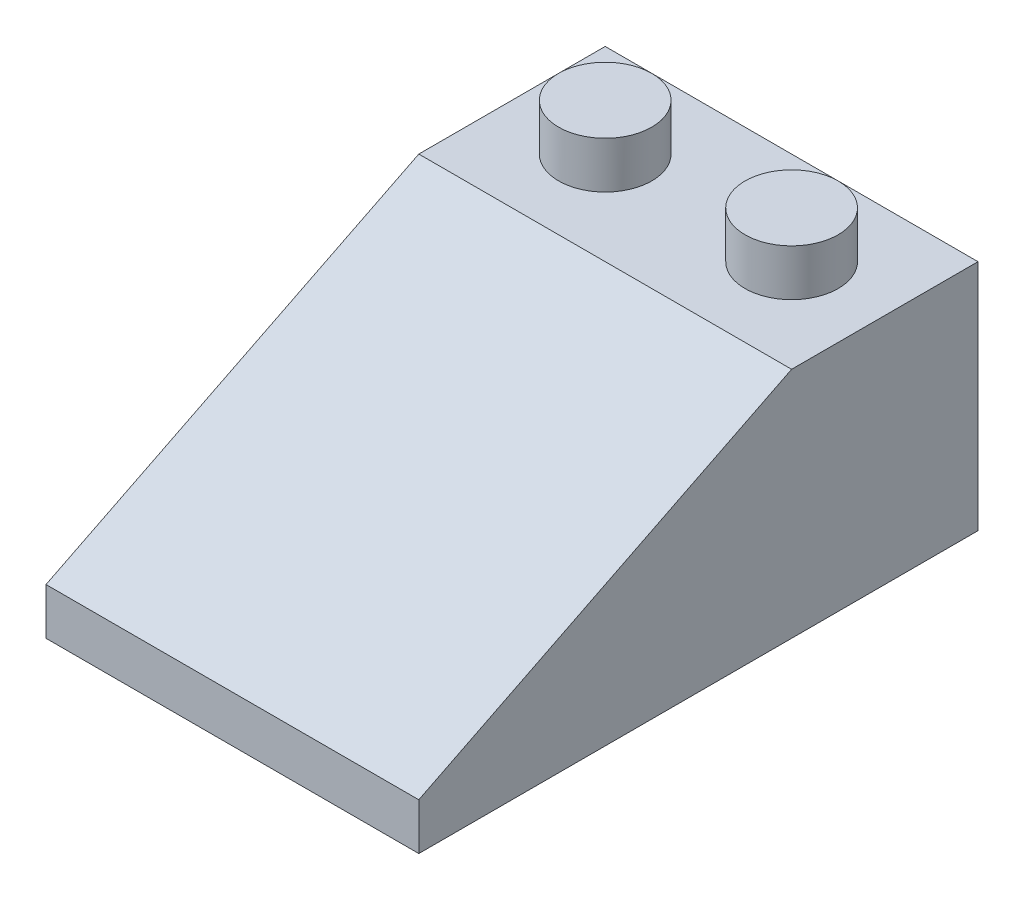
ISO-10303-21;
HEADER;
FILE_DESCRIPTION(('STEP AP214'),'2;1');
FILE_NAME('part.step','',(''),(''),'','','');
FILE_SCHEMA(('AUTOMOTIVE_DESIGN { 1 0 10303 214 1 1 1 1 }'));
ENDSEC;
DATA;
#1=APPLICATION_CONTEXT('core data for automotive mechanical design processes');
#2=APPLICATION_PROTOCOL_DEFINITION('international standard','automotive_design',2000,#1);
#3=PRODUCT_CONTEXT('',#1,'mechanical');
#4=PRODUCT('Part','Part','',(#3));
#5=PRODUCT_RELATED_PRODUCT_CATEGORY('part','',(#4));
#6=PRODUCT_DEFINITION_FORMATION('','',#4);
#7=PRODUCT_DEFINITION_CONTEXT('part definition',#1,'design');
#8=PRODUCT_DEFINITION('design','',#6,#7);
#9=PRODUCT_DEFINITION_SHAPE('','',#8);
#10=(LENGTH_UNIT() NAMED_UNIT(*) SI_UNIT(.MILLI.,.METRE.));
#11=(NAMED_UNIT(*) PLANE_ANGLE_UNIT() SI_UNIT($,.RADIAN.));
#12=(NAMED_UNIT(*) SI_UNIT($,.STERADIAN.) SOLID_ANGLE_UNIT());
#13=UNCERTAINTY_MEASURE_WITH_UNIT(LENGTH_MEASURE(1.E-05),#10,'distance_accuracy_value','');
#14=(GEOMETRIC_REPRESENTATION_CONTEXT(3) GLOBAL_UNCERTAINTY_ASSIGNED_CONTEXT((#13)) GLOBAL_UNIT_ASSIGNED_CONTEXT((#10,
#11,#12)) REPRESENTATION_CONTEXT('',''));
#15=CARTESIAN_POINT('',(0.,0.,0.));
#16=DIRECTION('',(0.,0.,1.));
#17=DIRECTION('',(1.,0.,0.));
#18=AXIS2_PLACEMENT_3D('',#15,#16,#17);
#19=CARTESIAN_POINT('',(16.,0.,24.));
#20=DIRECTION('',(0.,1.,0.));
#21=DIRECTION('',(0.,0.,1.));
#22=AXIS2_PLACEMENT_3D('',#19,#20,#21);
#23=PLANE('',#22);
#24=DIRECTION('',(0.,0.,-1.));
#25=VECTOR('',#24,1.);
#26=CARTESIAN_POINT('',(0.,0.,24.));
#27=LINE('',#26,#25);
#28=CARTESIAN_POINT('',(0.,0.,24.));
#29=VERTEX_POINT('',#28);
#30=CARTESIAN_POINT('',(0.,0.,0.));
#31=VERTEX_POINT('',#30);
#32=EDGE_CURVE('E227',#29,#31,#27,.T.);
#33=ORIENTED_EDGE('',*,*,#32,.T.);
#34=DIRECTION('',(-1.,0.,0.));
#35=VECTOR('',#34,1.);
#36=CARTESIAN_POINT('',(16.,0.,0.));
#37=LINE('',#36,#35);
#38=CARTESIAN_POINT('',(16.,0.,0.));
#39=VERTEX_POINT('',#38);
#40=EDGE_CURVE('E275',#39,#31,#37,.T.);
#41=ORIENTED_EDGE('',*,*,#40,.F.);
#42=DIRECTION('',(0.,0.,-1.));
#43=VECTOR('',#42,1.);
#44=CARTESIAN_POINT('',(16.,0.,24.));
#45=LINE('',#44,#43);
#46=CARTESIAN_POINT('',(16.,0.,24.));
#47=VERTEX_POINT('',#46);
#48=EDGE_CURVE('E228',#47,#39,#45,.T.);
#49=ORIENTED_EDGE('',*,*,#48,.F.);
#50=DIRECTION('',(-1.,0.,0.));
#51=VECTOR('',#50,1.);
#52=CARTESIAN_POINT('',(16.,0.,24.));
#53=LINE('',#52,#51);
#54=EDGE_CURVE('E245',#47,#29,#53,.T.);
#55=ORIENTED_EDGE('',*,*,#54,.T.);
#56=EDGE_LOOP('',(#33,#41,#49,#55));
#57=FACE_BOUND('',#56,.T.);
#58=DIRECTION('',(0.,0.,-1.));
#59=VECTOR('',#58,1.);
#60=CARTESIAN_POINT('',(1.,0.,24.));
#61=LINE('',#60,#59);
#62=CARTESIAN_POINT('',(1.,0.,23.));
#63=VERTEX_POINT('',#62);
#64=CARTESIAN_POINT('',(1.,0.,1.));
#65=VERTEX_POINT('',#64);
#66=EDGE_CURVE('E197',#63,#65,#61,.T.);
#67=ORIENTED_EDGE('',*,*,#66,.F.);
#68=DIRECTION('',(-1.,0.,0.));
#69=VECTOR('',#68,1.);
#70=CARTESIAN_POINT('',(16.,0.,23.));
#71=LINE('',#70,#69);
#72=CARTESIAN_POINT('',(15.,0.,23.));
#73=VERTEX_POINT('',#72);
#74=EDGE_CURVE('E183',#73,#63,#71,.T.);
#75=ORIENTED_EDGE('',*,*,#74,.F.);
#76=DIRECTION('',(0.,0.,-1.));
#77=VECTOR('',#76,1.);
#78=CARTESIAN_POINT('',(15.,0.,24.));
#79=LINE('',#78,#77);
#80=CARTESIAN_POINT('',(15.,0.,1.));
#81=VERTEX_POINT('',#80);
#82=EDGE_CURVE('E189',#73,#81,#79,.T.);
#83=ORIENTED_EDGE('',*,*,#82,.T.);
#84=DIRECTION('',(-1.,0.,0.));
#85=VECTOR('',#84,1.);
#86=CARTESIAN_POINT('',(16.,0.,1.));
#87=LINE('',#86,#85);
#88=EDGE_CURVE('E203',#81,#65,#87,.T.);
#89=ORIENTED_EDGE('',*,*,#88,.T.);
#90=EDGE_LOOP('',(#67,#75,#83,#89));
#91=FACE_BOUND('',#90,.T.);
#92=ADVANCED_FACE('F57',(#57,#91),#23,.F.);
#93=CARTESIAN_POINT('',(16.,0.,0.));
#94=DIRECTION('',(0.,0.,1.));
#95=DIRECTION('',(1.,0.,0.));
#96=AXIS2_PLACEMENT_3D('',#93,#94,#95);
#97=PLANE('',#96);
#98=DIRECTION('',(0.,1.,0.));
#99=VECTOR('',#98,1.);
#100=CARTESIAN_POINT('',(0.,0.,0.));
#101=LINE('',#100,#99);
#102=CARTESIAN_POINT('',(0.,10.,0.));
#103=VERTEX_POINT('',#102);
#104=EDGE_CURVE('E249',#31,#103,#101,.T.);
#105=ORIENTED_EDGE('',*,*,#104,.T.);
#106=DIRECTION('',(-1.,0.,0.));
#107=VECTOR('',#106,1.);
#108=CARTESIAN_POINT('',(16.,10.,0.));
#109=LINE('',#108,#107);
#110=CARTESIAN_POINT('',(16.,10.,0.));
#111=VERTEX_POINT('',#110);
#112=EDGE_CURVE('E271',#111,#103,#109,.T.);
#113=ORIENTED_EDGE('',*,*,#112,.F.);
#114=DIRECTION('',(0.,1.,0.));
#115=VECTOR('',#114,1.);
#116=CARTESIAN_POINT('',(16.,0.,0.));
#117=LINE('',#116,#115);
#118=EDGE_CURVE('E232',#39,#111,#117,.T.);
#119=ORIENTED_EDGE('',*,*,#118,.F.);
#120=ORIENTED_EDGE('',*,*,#40,.T.);
#121=EDGE_LOOP('',(#105,#113,#119,#120));
#122=FACE_BOUND('',#121,.T.);
#123=ADVANCED_FACE('F292',(#122),#97,.F.);
#124=CARTESIAN_POINT('',(16.,10.,0.));
#125=DIRECTION('',(0.,-1.,0.));
#126=DIRECTION('',(0.,0.,-1.));
#127=AXIS2_PLACEMENT_3D('',#124,#125,#126);
#128=PLANE('',#127);
#129=CARTESIAN_POINT('',(12.,10.,4.));
#130=DIRECTION('',(0.,-1.,0.));
#131=DIRECTION('',(0.,0.,-1.));
#132=AXIS2_PLACEMENT_3D('',#129,#130,#131);
#133=CIRCLE('',#132,2.);
#134=CARTESIAN_POINT('',(12.,10.,2.));
#135=VERTEX_POINT('',#134);
#136=EDGE_CURVE('E65',#135,#135,#133,.F.);
#137=ORIENTED_EDGE('',*,*,#136,.F.);
#138=EDGE_LOOP('',(#137));
#139=FACE_BOUND('',#138,.T.);
#140=CARTESIAN_POINT('',(4.,10.,4.));
#141=DIRECTION('',(0.,-1.,0.));
#142=DIRECTION('',(0.,0.,-1.));
#143=AXIS2_PLACEMENT_3D('',#140,#141,#142);
#144=CIRCLE('',#143,2.);
#145=CARTESIAN_POINT('',(4.,10.,2.));
#146=VERTEX_POINT('',#145);
#147=EDGE_CURVE('E279',#146,#146,#144,.F.);
#148=ORIENTED_EDGE('',*,*,#147,.F.);
#149=EDGE_LOOP('',(#148));
#150=FACE_BOUND('',#149,.T.);
#151=DIRECTION('',(0.,0.,1.));
#152=VECTOR('',#151,1.);
#153=CARTESIAN_POINT('',(0.,10.,0.));
#154=LINE('',#153,#152);
#155=CARTESIAN_POINT('',(0.,10.,8.));
#156=VERTEX_POINT('',#155);
#157=EDGE_CURVE('E252',#103,#156,#154,.T.);
#158=ORIENTED_EDGE('',*,*,#157,.T.);
#159=DIRECTION('',(-1.,0.,0.));
#160=VECTOR('',#159,1.);
#161=CARTESIAN_POINT('',(16.,10.,8.));
#162=LINE('',#161,#160);
#163=CARTESIAN_POINT('',(16.,10.,8.));
#164=VERTEX_POINT('',#163);
#165=EDGE_CURVE('E267',#164,#156,#162,.T.);
#166=ORIENTED_EDGE('',*,*,#165,.F.);
#167=DIRECTION('',(0.,0.,1.));
#168=VECTOR('',#167,1.);
#169=CARTESIAN_POINT('',(16.,10.,0.));
#170=LINE('',#169,#168);
#171=EDGE_CURVE('E236',#111,#164,#170,.T.);
#172=ORIENTED_EDGE('',*,*,#171,.F.);
#173=ORIENTED_EDGE('',*,*,#112,.T.);
#174=EDGE_LOOP('',(#158,#166,#172,#173));
#175=FACE_BOUND('',#174,.T.);
#176=ADVANCED_FACE('F288',(#139,#150,#175),#128,.F.);
#177=CARTESIAN_POINT('',(16.,10.,8.));
#178=DIRECTION('',(0.,-0.894427190999916,-0.447213595499958));
#179=DIRECTION('',(0.,0.447213595499958,-0.894427190999916));
#180=AXIS2_PLACEMENT_3D('',#177,#178,#179);
#181=PLANE('',#180);
#182=DIRECTION('',(0.,-0.447213595499958,0.894427190999916));
#183=VECTOR('',#182,1.);
#184=CARTESIAN_POINT('',(0.,10.,8.));
#185=LINE('',#184,#183);
#186=CARTESIAN_POINT('',(0.,2.,24.));
#187=VERTEX_POINT('',#186);
#188=EDGE_CURVE('E255',#156,#187,#185,.T.);
#189=ORIENTED_EDGE('',*,*,#188,.T.);
#190=DIRECTION('',(-1.,0.,0.));
#191=VECTOR('',#190,1.);
#192=CARTESIAN_POINT('',(16.,2.,24.));
#193=LINE('',#192,#191);
#194=CARTESIAN_POINT('',(16.,2.,24.));
#195=VERTEX_POINT('',#194);
#196=EDGE_CURVE('E263',#195,#187,#193,.T.);
#197=ORIENTED_EDGE('',*,*,#196,.F.);
#198=DIRECTION('',(0.,-0.447213595499958,0.894427190999916));
#199=VECTOR('',#198,1.);
#200=CARTESIAN_POINT('',(16.,10.,8.));
#201=LINE('',#200,#199);
#202=EDGE_CURVE('E239',#164,#195,#201,.T.);
#203=ORIENTED_EDGE('',*,*,#202,.F.);
#204=ORIENTED_EDGE('',*,*,#165,.T.);
#205=EDGE_LOOP('',(#189,#197,#203,#204));
#206=FACE_BOUND('',#205,.T.);
#207=ADVANCED_FACE('F291',(#206),#181,.F.);
#208=CARTESIAN_POINT('',(16.,2.,24.));
#209=DIRECTION('',(0.,0.,-1.));
#210=DIRECTION('',(-1.,0.,0.));
#211=AXIS2_PLACEMENT_3D('',#208,#209,#210);
#212=PLANE('',#211);
#213=DIRECTION('',(0.,-1.,0.));
#214=VECTOR('',#213,1.);
#215=CARTESIAN_POINT('',(0.,2.,24.));
#216=LINE('',#215,#214);
#217=EDGE_CURVE('E233',#187,#29,#216,.T.);
#218=ORIENTED_EDGE('',*,*,#217,.T.);
#219=ORIENTED_EDGE('',*,*,#54,.F.);
#220=DIRECTION('',(0.,-1.,0.));
#221=VECTOR('',#220,1.);
#222=CARTESIAN_POINT('',(16.,2.,24.));
#223=LINE('',#222,#221);
#224=EDGE_CURVE('E242',#195,#47,#223,.T.);
#225=ORIENTED_EDGE('',*,*,#224,.F.);
#226=ORIENTED_EDGE('',*,*,#196,.T.);
#227=EDGE_LOOP('',(#218,#219,#225,#226));
#228=FACE_BOUND('',#227,.T.);
#229=ADVANCED_FACE('F310',(#228),#212,.F.);
#230=CARTESIAN_POINT('',(16.,0.,0.));
#231=DIRECTION('',(1.,0.,0.));
#232=DIRECTION('',(0.,0.,-1.));
#233=AXIS2_PLACEMENT_3D('',#230,#231,#232);
#234=PLANE('',#233);
#235=ORIENTED_EDGE('',*,*,#48,.T.);
#236=ORIENTED_EDGE('',*,*,#118,.T.);
#237=ORIENTED_EDGE('',*,*,#171,.T.);
#238=ORIENTED_EDGE('',*,*,#202,.T.);
#239=ORIENTED_EDGE('',*,*,#224,.T.);
#240=EDGE_LOOP('',(#235,#236,#237,#238,#239));
#241=FACE_BOUND('',#240,.T.);
#242=ADVANCED_FACE('F317',(#241),#234,.T.);
#243=CARTESIAN_POINT('',(0.,0.,0.));
#244=DIRECTION('',(1.,0.,0.));
#245=DIRECTION('',(0.,0.,-1.));
#246=AXIS2_PLACEMENT_3D('',#243,#244,#245);
#247=PLANE('',#246);
#248=ORIENTED_EDGE('',*,*,#32,.F.);
#249=ORIENTED_EDGE('',*,*,#217,.F.);
#250=ORIENTED_EDGE('',*,*,#188,.F.);
#251=ORIENTED_EDGE('',*,*,#157,.F.);
#252=ORIENTED_EDGE('',*,*,#104,.F.);
#253=EDGE_LOOP('',(#248,#249,#250,#251,#252));
#254=FACE_BOUND('',#253,.T.);
#255=ADVANCED_FACE('F307',(#254),#247,.F.);
#256=CARTESIAN_POINT('',(4.,12.,4.));
#257=DIRECTION('',(0.,-1.,0.));
#258=DIRECTION('',(0.,0.,-1.));
#259=AXIS2_PLACEMENT_3D('',#256,#257,#258);
#260=CYLINDRICAL_SURFACE('',#259,2.);
#261=CARTESIAN_POINT('',(4.,12.,4.));
#262=DIRECTION('',(0.,1.,0.));
#263=DIRECTION('',(0.,0.,1.));
#264=AXIS2_PLACEMENT_3D('',#261,#262,#263);
#265=CIRCLE('',#264,2.);
#266=CARTESIAN_POINT('',(4.,12.,6.));
#267=VERTEX_POINT('',#266);
#268=EDGE_CURVE('E222',#267,#267,#265,.T.);
#269=ORIENTED_EDGE('',*,*,#268,.F.);
#270=EDGE_LOOP('',(#269));
#271=FACE_BOUND('',#270,.T.);
#272=ORIENTED_EDGE('',*,*,#147,.T.);
#273=EDGE_LOOP('',(#272));
#274=FACE_BOUND('',#273,.T.);
#275=ADVANCED_FACE('F330',(#271,#274),#260,.T.);
#276=CARTESIAN_POINT('',(4.,12.,4.));
#277=DIRECTION('',(0.,1.,0.));
#278=DIRECTION('',(0.,0.,1.));
#279=AXIS2_PLACEMENT_3D('',#276,#277,#278);
#280=PLANE('',#279);
#281=ORIENTED_EDGE('',*,*,#268,.T.);
#282=EDGE_LOOP('',(#281));
#283=FACE_BOUND('',#282,.T.);
#284=ADVANCED_FACE('F335',(#283),#280,.T.);
#285=CARTESIAN_POINT('',(12.,12.,4.));
#286=DIRECTION('',(0.,-1.,0.));
#287=DIRECTION('',(0.,0.,-1.));
#288=AXIS2_PLACEMENT_3D('',#285,#286,#287);
#289=CYLINDRICAL_SURFACE('',#288,2.);
#290=CARTESIAN_POINT('',(12.,12.,4.));
#291=DIRECTION('',(0.,1.,0.));
#292=DIRECTION('',(0.,0.,-1.));
#293=AXIS2_PLACEMENT_3D('',#290,#291,#292);
#294=CIRCLE('',#293,2.);
#295=CARTESIAN_POINT('',(12.,12.,2.));
#296=VERTEX_POINT('',#295);
#297=EDGE_CURVE('E218',#296,#296,#294,.T.);
#298=ORIENTED_EDGE('',*,*,#297,.F.);
#299=EDGE_LOOP('',(#298));
#300=FACE_BOUND('',#299,.T.);
#301=ORIENTED_EDGE('',*,*,#136,.T.);
#302=EDGE_LOOP('',(#301));
#303=FACE_BOUND('',#302,.T.);
#304=ADVANCED_FACE('F286',(#300,#303),#289,.T.);
#305=CARTESIAN_POINT('',(12.,12.,4.));
#306=DIRECTION('',(0.,-1.,0.));
#307=DIRECTION('',(0.,0.,-1.));
#308=AXIS2_PLACEMENT_3D('',#305,#306,#307);
#309=PLANE('',#308);
#310=ORIENTED_EDGE('',*,*,#297,.T.);
#311=EDGE_LOOP('',(#310));
#312=FACE_BOUND('',#311,.T.);
#313=ADVANCED_FACE('F340',(#312),#309,.F.);
#314=CARTESIAN_POINT('',(16.,0.,1.));
#315=DIRECTION('',(0.,0.,1.));
#316=DIRECTION('',(1.,0.,0.));
#317=AXIS2_PLACEMENT_3D('',#314,#315,#316);
#318=PLANE('',#317);
#319=DIRECTION('',(0.,1.,0.));
#320=VECTOR('',#319,1.);
#321=CARTESIAN_POINT('',(1.,0.,1.));
#322=LINE('',#321,#320);
#323=CARTESIAN_POINT('',(1.,9.,1.));
#324=VERTEX_POINT('',#323);
#325=EDGE_CURVE('E217',#65,#324,#322,.T.);
#326=ORIENTED_EDGE('',*,*,#325,.F.);
#327=ORIENTED_EDGE('',*,*,#88,.F.);
#328=DIRECTION('',(0.,1.,0.));
#329=VECTOR('',#328,1.);
#330=CARTESIAN_POINT('',(15.,0.,1.));
#331=LINE('',#330,#329);
#332=CARTESIAN_POINT('',(15.,9.,1.));
#333=VERTEX_POINT('',#332);
#334=EDGE_CURVE('E175',#81,#333,#331,.T.);
#335=ORIENTED_EDGE('',*,*,#334,.T.);
#336=DIRECTION('',(-1.,0.,0.));
#337=VECTOR('',#336,1.);
#338=CARTESIAN_POINT('',(16.,9.,1.));
#339=LINE('',#338,#337);
#340=EDGE_CURVE('E165',#333,#324,#339,.T.);
#341=ORIENTED_EDGE('',*,*,#340,.T.);
#342=EDGE_LOOP('',(#326,#327,#335,#341));
#343=FACE_BOUND('',#342,.T.);
#344=ADVANCED_FACE('F343',(#343),#318,.T.);
#345=CARTESIAN_POINT('',(16.,9.,0.));
#346=DIRECTION('',(0.,-1.,0.));
#347=DIRECTION('',(0.,0.,-1.));
#348=AXIS2_PLACEMENT_3D('',#345,#346,#347);
#349=PLANE('',#348);
#350=CARTESIAN_POINT('',(8.,9.,8.));
#351=DIRECTION('',(0.,-1.,0.));
#352=DIRECTION('',(0.,0.,-1.));
#353=AXIS2_PLACEMENT_3D('',#350,#351,#352);
#354=CIRCLE('',#353,2.7);
#355=CARTESIAN_POINT('',(10.6896601848559,9.,7.76393202250021));
#356=VERTEX_POINT('',#355);
#357=CARTESIAN_POINT('',(5.31033981514408,9.,7.76393202250021));
#358=VERTEX_POINT('',#357);
#359=EDGE_CURVE('E202',#356,#358,#354,.F.);
#360=ORIENTED_EDGE('',*,*,#359,.T.);
#361=DIRECTION('',(-1.,0.,0.));
#362=VECTOR('',#361,1.);
#363=CARTESIAN_POINT('',(16.,9.,7.76393202250021));
#364=LINE('',#363,#362);
#365=CARTESIAN_POINT('',(1.,9.,7.76393202250021));
#366=VERTEX_POINT('',#365);
#367=EDGE_CURVE('E161',#358,#366,#364,.T.);
#368=ORIENTED_EDGE('',*,*,#367,.T.);
#369=DIRECTION('',(0.,0.,1.));
#370=VECTOR('',#369,1.);
#371=CARTESIAN_POINT('',(1.,9.,0.));
#372=LINE('',#371,#370);
#373=EDGE_CURVE('E169',#324,#366,#372,.T.);
#374=ORIENTED_EDGE('',*,*,#373,.F.);
#375=ORIENTED_EDGE('',*,*,#340,.F.);
#376=DIRECTION('',(0.,0.,1.));
#377=VECTOR('',#376,1.);
#378=CARTESIAN_POINT('',(15.,9.,0.));
#379=LINE('',#378,#377);
#380=CARTESIAN_POINT('',(15.,9.,7.76393202250021));
#381=VERTEX_POINT('',#380);
#382=EDGE_CURVE('E171',#333,#381,#379,.T.);
#383=ORIENTED_EDGE('',*,*,#382,.T.);
#384=EDGE_CURVE('E160',#381,#356,#364,.T.);
#385=ORIENTED_EDGE('',*,*,#384,.T.);
#386=EDGE_LOOP('',(#360,#368,#374,#375,#383,#385));
#387=FACE_BOUND('',#386,.T.);
#388=CARTESIAN_POINT('',(12.,9.,4.));
#389=DIRECTION('',(0.,-1.,0.));
#390=DIRECTION('',(0.,0.,-1.));
#391=AXIS2_PLACEMENT_3D('',#388,#389,#390);
#392=CIRCLE('',#391,0.999999999999999);
#393=CARTESIAN_POINT('',(12.,9.,3.));
#394=VERTEX_POINT('',#393);
#395=EDGE_CURVE('E223',#394,#394,#392,.F.);
#396=ORIENTED_EDGE('',*,*,#395,.T.);
#397=EDGE_LOOP('',(#396));
#398=FACE_BOUND('',#397,.T.);
#399=CARTESIAN_POINT('',(4.,9.,4.));
#400=DIRECTION('',(0.,-1.,0.));
#401=DIRECTION('',(0.,0.,-1.));
#402=AXIS2_PLACEMENT_3D('',#399,#400,#401);
#403=CIRCLE('',#402,1.);
#404=CARTESIAN_POINT('',(4.,9.,3.));
#405=VERTEX_POINT('',#404);
#406=EDGE_CURVE('E207',#405,#405,#403,.F.);
#407=ORIENTED_EDGE('',*,*,#406,.T.);
#408=EDGE_LOOP('',(#407));
#409=FACE_BOUND('',#408,.T.);
#410=ADVANCED_FACE('F380',(#387,#398,#409),#349,.T.);
#411=CARTESIAN_POINT('',(16.,9.10557280900008,7.55278640450004));
#412=DIRECTION('',(0.,-0.894427190999916,-0.447213595499958));
#413=DIRECTION('',(0.,0.447213595499958,-0.894427190999916));
#414=AXIS2_PLACEMENT_3D('',#411,#412,#413);
#415=PLANE('',#414);
#416=CARTESIAN_POINT('',(8.,4.88196601125011,16.));
#417=DIRECTION('',(0.,-0.894427190999916,-0.447213595499958));
#418=DIRECTION('',(0.,-0.447213595499958,0.894427190999916));
#419=AXIS2_PLACEMENT_3D('',#416,#417,#418);
#420=ELLIPSE('',#419,3.01869176962471,2.7);
#421=CARTESIAN_POINT('',(8.,3.53196601125011,18.7));
#422=VERTEX_POINT('',#421);
#423=EDGE_CURVE('E12',#422,#422,#420,.T.);
#424=ORIENTED_EDGE('',*,*,#423,.F.);
#425=EDGE_LOOP('',(#424));
#426=FACE_BOUND('',#425,.T.);
#427=CARTESIAN_POINT('',(8.,8.88196601125011,8.));
#428=DIRECTION('',(0.,-0.894427190999916,-0.447213595499958));
#429=DIRECTION('',(0.,-0.447213595499958,0.894427190999916));
#430=AXIS2_PLACEMENT_3D('',#427,#428,#429);
#431=ELLIPSE('',#430,3.01869176962472,2.7);
#432=EDGE_CURVE('E79',#358,#356,#431,.F.);
#433=ORIENTED_EDGE('',*,*,#432,.T.);
#434=ORIENTED_EDGE('',*,*,#384,.F.);
#435=DIRECTION('',(0.,-0.447213595499958,0.894427190999916));
#436=VECTOR('',#435,1.);
#437=CARTESIAN_POINT('',(15.,9.10557280900008,7.55278640450004));
#438=LINE('',#437,#436);
#439=CARTESIAN_POINT('',(15.,1.38196601125011,23.));
#440=VERTEX_POINT('',#439);
#441=EDGE_CURVE('E174',#381,#440,#438,.T.);
#442=ORIENTED_EDGE('',*,*,#441,.T.);
#443=DIRECTION('',(-1.,0.,0.));
#444=VECTOR('',#443,1.);
#445=CARTESIAN_POINT('',(16.,1.38196601125011,23.));
#446=LINE('',#445,#444);
#447=CARTESIAN_POINT('',(1.,1.38196601125011,23.));
#448=VERTEX_POINT('',#447);
#449=EDGE_CURVE('E166',#440,#448,#446,.T.);
#450=ORIENTED_EDGE('',*,*,#449,.T.);
#451=DIRECTION('',(0.,-0.447213595499958,0.894427190999916));
#452=VECTOR('',#451,1.);
#453=CARTESIAN_POINT('',(1.,9.10557280900008,7.55278640450004));
#454=LINE('',#453,#452);
#455=EDGE_CURVE('E176',#366,#448,#454,.T.);
#456=ORIENTED_EDGE('',*,*,#455,.F.);
#457=ORIENTED_EDGE('',*,*,#367,.F.);
#458=EDGE_LOOP('',(#433,#434,#442,#450,#456,#457));
#459=FACE_BOUND('',#458,.T.);
#460=ADVANCED_FACE('F376',(#426,#459),#415,.T.);
#461=CARTESIAN_POINT('',(16.,2.,23.));
#462=DIRECTION('',(0.,0.,-1.));
#463=DIRECTION('',(-1.,0.,0.));
#464=AXIS2_PLACEMENT_3D('',#461,#462,#463);
#465=PLANE('',#464);
#466=DIRECTION('',(0.,-1.,0.));
#467=VECTOR('',#466,1.);
#468=CARTESIAN_POINT('',(1.,2.,23.));
#469=LINE('',#468,#467);
#470=EDGE_CURVE('E179',#448,#63,#469,.T.);
#471=ORIENTED_EDGE('',*,*,#470,.F.);
#472=ORIENTED_EDGE('',*,*,#449,.F.);
#473=DIRECTION('',(0.,-1.,0.));
#474=VECTOR('',#473,1.);
#475=CARTESIAN_POINT('',(15.,2.,23.));
#476=LINE('',#475,#474);
#477=EDGE_CURVE('E186',#440,#73,#476,.T.);
#478=ORIENTED_EDGE('',*,*,#477,.T.);
#479=ORIENTED_EDGE('',*,*,#74,.T.);
#480=EDGE_LOOP('',(#471,#472,#478,#479));
#481=FACE_BOUND('',#480,.T.);
#482=ADVANCED_FACE('F372',(#481),#465,.T.);
#483=CARTESIAN_POINT('',(15.,0.,0.));
#484=DIRECTION('',(1.,0.,0.));
#485=DIRECTION('',(0.,0.,-1.));
#486=AXIS2_PLACEMENT_3D('',#483,#484,#485);
#487=PLANE('',#486);
#488=ORIENTED_EDGE('',*,*,#82,.F.);
#489=ORIENTED_EDGE('',*,*,#477,.F.);
#490=ORIENTED_EDGE('',*,*,#441,.F.);
#491=ORIENTED_EDGE('',*,*,#382,.F.);
#492=ORIENTED_EDGE('',*,*,#334,.F.);
#493=EDGE_LOOP('',(#488,#489,#490,#491,#492));
#494=FACE_BOUND('',#493,.T.);
#495=ADVANCED_FACE('F368',(#494),#487,.F.);
#496=CARTESIAN_POINT('',(1.,0.,0.));
#497=DIRECTION('',(1.,0.,0.));
#498=DIRECTION('',(0.,0.,-1.));
#499=AXIS2_PLACEMENT_3D('',#496,#497,#498);
#500=PLANE('',#499);
#501=ORIENTED_EDGE('',*,*,#66,.T.);
#502=ORIENTED_EDGE('',*,*,#325,.T.);
#503=ORIENTED_EDGE('',*,*,#373,.T.);
#504=ORIENTED_EDGE('',*,*,#455,.T.);
#505=ORIENTED_EDGE('',*,*,#470,.T.);
#506=EDGE_LOOP('',(#501,#502,#503,#504,#505));
#507=FACE_BOUND('',#506,.T.);
#508=ADVANCED_FACE('F364',(#507),#500,.T.);
#509=CARTESIAN_POINT('',(4.,12.,4.));
#510=DIRECTION('',(0.,-1.,0.));
#511=DIRECTION('',(0.,0.,-1.));
#512=AXIS2_PLACEMENT_3D('',#509,#510,#511);
#513=CYLINDRICAL_SURFACE('',#512,1.);
#514=CARTESIAN_POINT('',(4.,11.,4.));
#515=DIRECTION('',(0.,1.,0.));
#516=DIRECTION('',(0.,0.,1.));
#517=AXIS2_PLACEMENT_3D('',#514,#515,#516);
#518=CIRCLE('',#517,1.);
#519=CARTESIAN_POINT('',(4.,11.,5.));
#520=VERTEX_POINT('',#519);
#521=EDGE_CURVE('E193',#520,#520,#518,.T.);
#522=ORIENTED_EDGE('',*,*,#521,.T.);
#523=EDGE_LOOP('',(#522));
#524=FACE_BOUND('',#523,.T.);
#525=ORIENTED_EDGE('',*,*,#406,.F.);
#526=EDGE_LOOP('',(#525));
#527=FACE_BOUND('',#526,.T.);
#528=ADVANCED_FACE('F360',(#524,#527),#513,.F.);
#529=CARTESIAN_POINT('',(4.,11.,4.));
#530=DIRECTION('',(0.,1.,0.));
#531=DIRECTION('',(0.,0.,1.));
#532=AXIS2_PLACEMENT_3D('',#529,#530,#531);
#533=PLANE('',#532);
#534=ORIENTED_EDGE('',*,*,#521,.F.);
#535=EDGE_LOOP('',(#534));
#536=FACE_BOUND('',#535,.T.);
#537=ADVANCED_FACE('F356',(#536),#533,.F.);
#538=CARTESIAN_POINT('',(12.,12.,4.));
#539=DIRECTION('',(0.,-1.,0.));
#540=DIRECTION('',(0.,0.,-1.));
#541=AXIS2_PLACEMENT_3D('',#538,#539,#540);
#542=CYLINDRICAL_SURFACE('',#541,0.999999999999999);
#543=CARTESIAN_POINT('',(12.,11.,4.));
#544=DIRECTION('',(0.,-1.,0.));
#545=DIRECTION('',(0.,0.,-1.));
#546=AXIS2_PLACEMENT_3D('',#543,#544,#545);
#547=CIRCLE('',#546,0.999999999999999);
#548=CARTESIAN_POINT('',(12.,11.,3.));
#549=VERTEX_POINT('',#548);
#550=EDGE_CURVE('E198',#549,#549,#547,.F.);
#551=ORIENTED_EDGE('',*,*,#550,.T.);
#552=EDGE_LOOP('',(#551));
#553=FACE_BOUND('',#552,.T.);
#554=ORIENTED_EDGE('',*,*,#395,.F.);
#555=EDGE_LOOP('',(#554));
#556=FACE_BOUND('',#555,.T.);
#557=ADVANCED_FACE('F352',(#553,#556),#542,.F.);
#558=CARTESIAN_POINT('',(12.,11.,4.));
#559=DIRECTION('',(0.,-1.,0.));
#560=DIRECTION('',(0.,0.,-1.));
#561=AXIS2_PLACEMENT_3D('',#558,#559,#560);
#562=PLANE('',#561);
#563=ORIENTED_EDGE('',*,*,#550,.F.);
#564=EDGE_LOOP('',(#563));
#565=FACE_BOUND('',#564,.T.);
#566=ADVANCED_FACE('F348',(#565),#562,.T.);
#567=CARTESIAN_POINT('',(8.,0.,8.));
#568=DIRECTION('',(0.,-1.,0.));
#569=DIRECTION('',(0.,0.,-1.));
#570=AXIS2_PLACEMENT_3D('',#567,#568,#569);
#571=PLANE('',#570);
#572=CARTESIAN_POINT('',(8.,0.,8.));
#573=DIRECTION('',(0.,-1.,0.));
#574=DIRECTION('',(0.,0.,-1.));
#575=AXIS2_PLACEMENT_3D('',#572,#573,#574);
#576=CIRCLE('',#575,1.7);
#577=CARTESIAN_POINT('',(8.,0.,6.3));
#578=VERTEX_POINT('',#577);
#579=EDGE_CURVE('E156',#578,#578,#576,.T.);
#580=ORIENTED_EDGE('',*,*,#579,.F.);
#581=EDGE_LOOP('',(#580));
#582=FACE_BOUND('',#581,.T.);
#583=CARTESIAN_POINT('',(8.,0.,8.));
#584=DIRECTION('',(0.,-1.,0.));
#585=DIRECTION('',(0.,0.,-1.));
#586=AXIS2_PLACEMENT_3D('',#583,#584,#585);
#587=CIRCLE('',#586,2.7);
#588=CARTESIAN_POINT('',(8.,0.,5.3));
#589=VERTEX_POINT('',#588);
#590=EDGE_CURVE('E418',#589,#589,#587,.T.);
#591=ORIENTED_EDGE('',*,*,#590,.T.);
#592=EDGE_LOOP('',(#591));
#593=FACE_BOUND('',#592,.T.);
#594=ADVANCED_FACE('F351',(#582,#593),#571,.T.);
#595=CARTESIAN_POINT('',(8.,12.002,8.));
#596=DIRECTION('',(0.,-1.,0.));
#597=DIRECTION('',(0.,0.,-1.));
#598=AXIS2_PLACEMENT_3D('',#595,#596,#597);
#599=CYLINDRICAL_SURFACE('',#598,2.7);
#600=ORIENTED_EDGE('',*,*,#432,.F.);
#601=ORIENTED_EDGE('',*,*,#359,.F.);
#602=EDGE_LOOP('',(#600,#601));
#603=FACE_BOUND('',#602,.T.);
#604=ORIENTED_EDGE('',*,*,#590,.F.);
#605=EDGE_LOOP('',(#604));
#606=FACE_BOUND('',#605,.T.);
#607=ADVANCED_FACE('F389',(#603,#606),#599,.T.);
#608=CARTESIAN_POINT('',(8.,12.002,8.));
#609=DIRECTION('',(0.,-1.,0.));
#610=DIRECTION('',(0.,0.,-1.));
#611=AXIS2_PLACEMENT_3D('',#608,#609,#610);
#612=CYLINDRICAL_SURFACE('',#611,1.7);
#613=CARTESIAN_POINT('',(8.,9.,8.));
#614=DIRECTION('',(0.,-1.,0.));
#615=DIRECTION('',(0.,0.,-1.));
#616=AXIS2_PLACEMENT_3D('',#613,#614,#615);
#617=CIRCLE('',#616,1.7);
#618=CARTESIAN_POINT('',(9.68352959878915,9.,7.76393202250021));
#619=VERTEX_POINT('',#618);
#620=CARTESIAN_POINT('',(6.31647040121086,9.,7.76393202250021));
#621=VERTEX_POINT('',#620);
#622=EDGE_CURVE('E71',#619,#621,#617,.F.);
#623=ORIENTED_EDGE('',*,*,#622,.T.);
#624=CARTESIAN_POINT('',(8.,8.88196601125011,8.));
#625=DIRECTION('',(0.,-0.894427190999916,-0.447213595499958));
#626=DIRECTION('',(0.,-0.447213595499958,0.894427190999916));
#627=AXIS2_PLACEMENT_3D('',#624,#625,#626);
#628=ELLIPSE('',#627,1.90065778087482,1.7);
#629=EDGE_CURVE('E144',#621,#619,#628,.F.);
#630=ORIENTED_EDGE('',*,*,#629,.T.);
#631=EDGE_LOOP('',(#623,#630));
#632=FACE_BOUND('',#631,.T.);
#633=ORIENTED_EDGE('',*,*,#579,.T.);
#634=EDGE_LOOP('',(#633));
#635=FACE_BOUND('',#634,.T.);
#636=ADVANCED_FACE('F145',(#632,#635),#612,.F.);
#637=EDGE_CURVE('E154',#619,#621,#364,.T.);
#638=ORIENTED_EDGE('',*,*,#637,.F.);
#639=ORIENTED_EDGE('',*,*,#629,.F.);
#640=EDGE_LOOP('',(#638,#639));
#641=FACE_BOUND('',#640,.T.);
#642=ADVANCED_FACE('F158',(#641),#415,.T.);
#643=ORIENTED_EDGE('',*,*,#637,.T.);
#644=ORIENTED_EDGE('',*,*,#622,.F.);
#645=EDGE_LOOP('',(#643,#644));
#646=FACE_BOUND('',#645,.T.);
#647=ADVANCED_FACE('F153',(#646),#349,.T.);
#648=CARTESIAN_POINT('',(8.,0.,16.));
#649=DIRECTION('',(0.,1.,0.));
#650=DIRECTION('',(0.,0.,1.));
#651=AXIS2_PLACEMENT_3D('',#648,#649,#650);
#652=PLANE('',#651);
#653=CARTESIAN_POINT('',(8.,0.,16.));
#654=DIRECTION('',(0.,-1.,0.));
#655=DIRECTION('',(0.,0.,1.));
#656=AXIS2_PLACEMENT_3D('',#653,#654,#655);
#657=CIRCLE('',#656,1.7);
#658=CARTESIAN_POINT('',(8.,0.,17.7));
#659=VERTEX_POINT('',#658);
#660=EDGE_CURVE('E419',#659,#659,#657,.T.);
#661=ORIENTED_EDGE('',*,*,#660,.F.);
#662=EDGE_LOOP('',(#661));
#663=FACE_BOUND('',#662,.T.);
#664=CARTESIAN_POINT('',(8.,0.,16.));
#665=DIRECTION('',(0.,-1.,0.));
#666=DIRECTION('',(0.,0.,1.));
#667=AXIS2_PLACEMENT_3D('',#664,#665,#666);
#668=CIRCLE('',#667,2.7);
#669=CARTESIAN_POINT('',(8.,0.,18.7));
#670=VERTEX_POINT('',#669);
#671=EDGE_CURVE('E415',#670,#670,#668,.T.);
#672=ORIENTED_EDGE('',*,*,#671,.T.);
#673=EDGE_LOOP('',(#672));
#674=FACE_BOUND('',#673,.T.);
#675=ADVANCED_FACE('F398',(#663,#674),#652,.F.);
#676=CARTESIAN_POINT('',(8.,12.002,16.));
#677=DIRECTION('',(0.,-1.,0.));
#678=DIRECTION('',(0.,0.,-1.));
#679=AXIS2_PLACEMENT_3D('',#676,#677,#678);
#680=CYLINDRICAL_SURFACE('',#679,2.7);
#681=ORIENTED_EDGE('',*,*,#423,.T.);
#682=EDGE_LOOP('',(#681));
#683=FACE_BOUND('',#682,.T.);
#684=ORIENTED_EDGE('',*,*,#671,.F.);
#685=EDGE_LOOP('',(#684));
#686=FACE_BOUND('',#685,.T.);
#687=ADVANCED_FACE('F401',(#683,#686),#680,.T.);
#688=CARTESIAN_POINT('',(8.,12.002,16.));
#689=DIRECTION('',(0.,-1.,0.));
#690=DIRECTION('',(0.,0.,-1.));
#691=AXIS2_PLACEMENT_3D('',#688,#689,#690);
#692=CYLINDRICAL_SURFACE('',#691,1.7);
#693=CARTESIAN_POINT('',(8.,4.88196601125011,16.));
#694=DIRECTION('',(0.,-0.894427190999916,-0.447213595499958));
#695=DIRECTION('',(0.,-0.447213595499958,0.894427190999916));
#696=AXIS2_PLACEMENT_3D('',#693,#694,#695);
#697=ELLIPSE('',#696,1.90065778087482,1.7);
#698=CARTESIAN_POINT('',(8.,4.03196601125011,17.7));
#699=VERTEX_POINT('',#698);
#700=EDGE_CURVE('E426',#699,#699,#697,.F.);
#701=ORIENTED_EDGE('',*,*,#700,.T.);
#702=EDGE_LOOP('',(#701));
#703=FACE_BOUND('',#702,.T.);
#704=ORIENTED_EDGE('',*,*,#660,.T.);
#705=EDGE_LOOP('',(#704));
#706=FACE_BOUND('',#705,.T.);
#707=ADVANCED_FACE('F403',(#703,#706),#692,.F.);
#708=ORIENTED_EDGE('',*,*,#700,.F.);
#709=EDGE_LOOP('',(#708));
#710=FACE_BOUND('',#709,.T.);
#711=ADVANCED_FACE('F382',(#710),#415,.T.);
#712=CLOSED_SHELL('',(#92,#123,#176,#207,#229,#242,#255,#275,#284,#304,#313,#344,#410,#460,#482,
#495,#508,#528,#537,#557,#566,#594,#607,#636,#642,#647,#675,#687,#707,#711));
#713=MANIFOLD_SOLID_BREP('B2',#712);
#714=ADVANCED_BREP_SHAPE_REPRESENTATION('',(#18,#713),#14);
#715=SHAPE_DEFINITION_REPRESENTATION(#9,#714);
ENDSEC;
END-ISO-10303-21;
